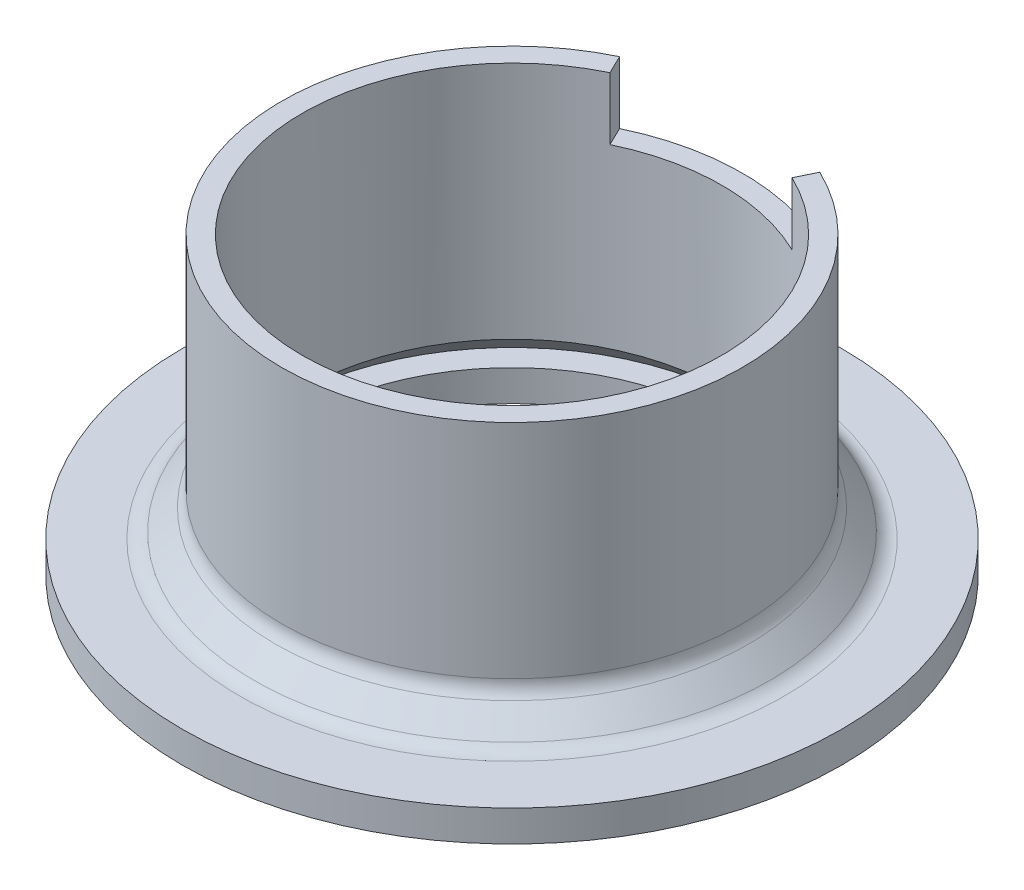
ISO-10303-21;
HEADER;
FILE_DESCRIPTION(('STEP AP214'),'2;1');
FILE_NAME('part.step','',(''),(''),'','','');
FILE_SCHEMA(('AUTOMOTIVE_DESIGN { 1 0 10303 214 1 1 1 1 }'));
ENDSEC;
DATA;
#1=APPLICATION_CONTEXT('core data for automotive mechanical design processes');
#2=APPLICATION_PROTOCOL_DEFINITION('international standard','automotive_design',2000,#1);
#3=PRODUCT_CONTEXT('',#1,'mechanical');
#4=PRODUCT('Part','Part','',(#3));
#5=PRODUCT_RELATED_PRODUCT_CATEGORY('part','',(#4));
#6=PRODUCT_DEFINITION_FORMATION('','',#4);
#7=PRODUCT_DEFINITION_CONTEXT('part definition',#1,'design');
#8=PRODUCT_DEFINITION('design','',#6,#7);
#9=PRODUCT_DEFINITION_SHAPE('','',#8);
#10=(LENGTH_UNIT() NAMED_UNIT(*) SI_UNIT(.MILLI.,.METRE.));
#11=(NAMED_UNIT(*) PLANE_ANGLE_UNIT() SI_UNIT($,.RADIAN.));
#12=(NAMED_UNIT(*) SI_UNIT($,.STERADIAN.) SOLID_ANGLE_UNIT());
#13=UNCERTAINTY_MEASURE_WITH_UNIT(LENGTH_MEASURE(1.E-05),#10,'distance_accuracy_value','');
#14=(GEOMETRIC_REPRESENTATION_CONTEXT(3) GLOBAL_UNCERTAINTY_ASSIGNED_CONTEXT((#13)) GLOBAL_UNIT_ASSIGNED_CONTEXT((#10,
#11,#12)) REPRESENTATION_CONTEXT('',''));
#15=CARTESIAN_POINT('',(0.,0.,0.));
#16=DIRECTION('',(0.,0.,1.));
#17=DIRECTION('',(1.,0.,0.));
#18=AXIS2_PLACEMENT_3D('',#15,#16,#17);
#19=CARTESIAN_POINT('',(0.,0.,0.));
#20=DIRECTION('',(0.,-1.,0.));
#21=DIRECTION('',(0.,0.,-1.));
#22=AXIS2_PLACEMENT_3D('',#19,#20,#21);
#23=CONICAL_SURFACE('',#22,22.5715728752538,0.785398163397448);
#24=CARTESIAN_POINT('',(0.,0.,0.));
#25=DIRECTION('',(0.,1.,0.));
#26=DIRECTION('',(0.,0.,1.));
#27=AXIS2_PLACEMENT_3D('',#24,#25,#26);
#28=CIRCLE('',#27,22.5715728752538);
#29=CARTESIAN_POINT('',(1.00000000000024,0.,22.5494102375848));
#30=VERTEX_POINT('',#29);
#31=CARTESIAN_POINT('',(22.5494102375848,0.,1.));
#32=VERTEX_POINT('',#31);
#33=EDGE_CURVE('E211',#30,#32,#28,.T.);
#34=ORIENTED_EDGE('',*,*,#33,.F.);
#35=CARTESIAN_POINT('',(1.00000000000027,-3.0926493253987,25.644732425285));
#36=CARTESIAN_POINT('',(1.00000000000026,-2.38144524293219,24.9329862035659));
#37=CARTESIAN_POINT('',(1.00000000000025,-1.67026202271059,24.2212191333853));
#38=CARTESIAN_POINT('',(1.00000000000024,-0.247954460315439,22.7976261871441));
#39=CARTESIAN_POINT('',(1.00000000000023,0.463169881858879,22.0858003110842));
#40=CARTESIAN_POINT('',(1.00000000000022,1.88534255816285,20.6620726205477));
#41=CARTESIAN_POINT('',(1.00000000000021,2.59639089229196,19.9501708060707));
#42=CARTESIAN_POINT('',(1.00000000000019,4.01837974852563,18.5262594934386));
#43=CARTESIAN_POINT('',(1.00000000000019,4.72932027062876,17.8142499952823));
#44=CARTESIAN_POINT('',(1.00000000000018,5.44019097783295,17.10217078956));
#45=B_SPLINE_CURVE_WITH_KNOTS('',3,(#35,#36,#37,#38,#39,#40,#41,#42,#43,#44),.UNSPECIFIED.,.F.,
.F.,(4,2,2,2,4),(0.,3.01853364877657,6.03706725821883,9.05560088899381,12.0741345597101),.UNSPECIFIED.);
#46=CARTESIAN_POINT('',(1.00000000000021,2.34683554692244,20.2));
#47=VERTEX_POINT('',#46);
#48=EDGE_CURVE('E462',#30,#47,#45,.T.);
#49=ORIENTED_EDGE('',*,*,#48,.T.);
#50=CARTESIAN_POINT('',(-6.5069413407723,1.34940791471657,20.2000000000001));
#51=CARTESIAN_POINT('',(-6.27177744659428,1.42151188061224,20.2000000000001));
#52=CARTESIAN_POINT('',(-6.035627758326,1.49037548259756,20.2000000000001));
#53=CARTESIAN_POINT('',(-5.56140065408711,1.62122178355149,20.2000000000001));
#54=CARTESIAN_POINT('',(-5.32332300692677,1.68320364378869,20.2000000000001));
#55=CARTESIAN_POINT('',(-4.60601502671594,1.85828278435188,20.2));
#56=CARTESIAN_POINT('',(-4.12403971023993,1.96041133415662,20.2));
#57=CARTESIAN_POINT('',(-3.16355454162542,2.1307071040694,20.2));
#58=CARTESIAN_POINT('',(-2.68515289396587,2.19948283286201,20.2));
#59=CARTESIAN_POINT('',(-1.72487503342651,2.30367834314739,20.2));
#60=CARTESIAN_POINT('',(-1.24300024462189,2.33911109036389,20.2));
#61=CARTESIAN_POINT('',(-0.277385611884381,2.37543620653485,20.2));
#62=CARTESIAN_POINT('',(0.206355732604704,2.37628912458079,20.2));
#63=CARTESIAN_POINT('',(1.17279146788919,2.34332329522053,20.2));
#64=CARTESIAN_POINT('',(1.65548546383504,2.30949319051694,20.2));
#65=CARTESIAN_POINT('',(2.62662851013934,2.20735054038173,20.2));
#66=CARTESIAN_POINT('',(3.1150090788247,2.13838571552495,20.2));
#67=CARTESIAN_POINT('',(3.84307622424172,2.0106377609058,20.2));
#68=CARTESIAN_POINT('',(4.08497087652045,1.96401572473394,20.2));
#69=CARTESIAN_POINT('',(4.56711753771044,1.86304800041714,20.2));
#70=CARTESIAN_POINT('',(4.8073697202366,1.80870314225827,20.2));
#71=CARTESIAN_POINT('',(5.04674065574689,1.75067973287477,20.1999999999999));
#72=B_SPLINE_CURVE_WITH_KNOTS('',3,(#50,#51,#52,#53,#54,#55,#56,#57,#58,#59,#60,#61,#62,#63,#64,
#65,#66,#67,#68,#69,#70,#71),.UNSPECIFIED.,.F.,.F.,(4,2,2,2,2,2,2,2,2,2,4),(0.,
0.737864513970868,1.47581885874038,2.95276251623984,4.40163875350358,5.8499513488727,
7.29991622660368,8.75035606131851,10.2287618292153,10.9676947858209,11.7065483879013),.UNSPECIFIED.);
#73=CARTESIAN_POINT('',(2.11583769133894E-13,2.37157287525381,20.2));
#74=VERTEX_POINT('',#73);
#75=EDGE_CURVE('E488',#74,#47,#72,.T.);
#76=ORIENTED_EDGE('',*,*,#75,.F.);
#77=CARTESIAN_POINT('',(0.,2.37157287525381,0.));
#78=DIRECTION('',(0.,1.,0.));
#79=DIRECTION('',(0.,0.,1.));
#80=AXIS2_PLACEMENT_3D('',#77,#78,#79);
#81=CIRCLE('',#80,20.2);
#82=CARTESIAN_POINT('',(20.2,2.37157287525381,0.));
#83=VERTEX_POINT('',#82);
#84=EDGE_CURVE('E216',#74,#83,#81,.T.);
#85=ORIENTED_EDGE('',*,*,#84,.T.);
#86=CARTESIAN_POINT('',(20.2,1.75067973287477,5.04674065574667));
#87=CARTESIAN_POINT('',(20.2,1.80870314225827,4.80736972023639));
#88=CARTESIAN_POINT('',(20.2,1.86304800041714,4.56711753771022));
#89=CARTESIAN_POINT('',(20.2,1.96401572473394,4.08497087652023));
#90=CARTESIAN_POINT('',(20.2,2.0106377609058,3.8430762242415));
#91=CARTESIAN_POINT('',(20.2,2.13838571552495,3.11500907882448));
#92=CARTESIAN_POINT('',(20.2,2.20735054038173,2.62662851013912));
#93=CARTESIAN_POINT('',(20.2,2.30949319051693,1.65548546383482));
#94=CARTESIAN_POINT('',(20.2,2.34332329522053,1.17279146788897));
#95=CARTESIAN_POINT('',(20.2,2.37628912458079,0.206355732604489));
#96=CARTESIAN_POINT('',(20.2,2.37543620653485,-0.277385611884596));
#97=CARTESIAN_POINT('',(20.2,2.33911109036389,-1.24300024462211));
#98=CARTESIAN_POINT('',(20.2,2.30367834314739,-1.72487503342673));
#99=CARTESIAN_POINT('',(20.2,2.19948283286201,-2.68515289396609));
#100=CARTESIAN_POINT('',(20.2,2.1307071040694,-3.16355454162564));
#101=CARTESIAN_POINT('',(20.2,1.96041133415662,-4.12403971024014));
#102=CARTESIAN_POINT('',(20.2,1.85828278435188,-4.60601502671615));
#103=CARTESIAN_POINT('',(20.2,1.68320364378869,-5.32332300692699));
#104=CARTESIAN_POINT('',(20.2,1.62122178355149,-5.56140065408732));
#105=CARTESIAN_POINT('',(20.2,1.49037548259757,-6.03562775832621));
#106=CARTESIAN_POINT('',(20.2,1.42151188061224,-6.27177744659449));
#107=CARTESIAN_POINT('',(20.2,1.34940791471657,-6.50694134077251));
#108=B_SPLINE_CURVE_WITH_KNOTS('',3,(#86,#87,#88,#89,#90,#91,#92,#93,#94,#95,#96,#97,#98,#99,
#100,#101,#102,#103,#104,#105,#106,#107),.UNSPECIFIED.,.F.,.F.,(4,2,2,2,2,2,2,2,2,2,4),(0.,
0.738853602080394,1.47778655868599,2.95619232658281,4.40663216129764,5.85659703902863,
7.30490963439775,8.75378587166148,10.2307295291609,10.9686838739305,11.7065483879013),.UNSPECIFIED.);
#109=CARTESIAN_POINT('',(20.2,2.34683554692244,1.));
#110=VERTEX_POINT('',#109);
#111=EDGE_CURVE('E242',#110,#83,#108,.T.);
#112=ORIENTED_EDGE('',*,*,#111,.F.);
#113=CARTESIAN_POINT('',(25.644732425285,-3.09264932539868,1.));
#114=CARTESIAN_POINT('',(24.9329862035659,-2.38144524293218,1.));
#115=CARTESIAN_POINT('',(24.2212191333853,-1.67026202271058,1.));
#116=CARTESIAN_POINT('',(22.7976261871441,-0.247954460315433,1.));
#117=CARTESIAN_POINT('',(22.0858003110842,0.463169881858883,1.));
#118=CARTESIAN_POINT('',(20.6620726205477,1.88534255816285,1.));
#119=CARTESIAN_POINT('',(19.9501708060707,2.59639089229196,1.));
#120=CARTESIAN_POINT('',(18.5262594934387,4.01837974852563,1.));
#121=CARTESIAN_POINT('',(17.8142499952823,4.72932027062875,1.));
#122=CARTESIAN_POINT('',(17.10217078956,5.44019097783294,1.));
#123=B_SPLINE_CURVE_WITH_KNOTS('',3,(#113,#114,#115,#116,#117,#118,#119,#120,#121,#122),
.UNSPECIFIED.,.F.,.F.,(4,2,2,2,4),(0.,3.01853364877657,6.03706725821882,9.05560088899379,
12.0741345597101),.UNSPECIFIED.);
#124=EDGE_CURVE('E396',#32,#110,#123,.T.);
#125=ORIENTED_EDGE('',*,*,#124,.F.);
#126=EDGE_LOOP('',(#34,#49,#76,#85,#112,#125));
#127=FACE_BOUND('',#126,.T.);
#128=ADVANCED_FACE('F36',(#127),#23,.F.);
#129=CARTESIAN_POINT('',(0.,0.,0.));
#130=DIRECTION('',(0.,-1.,0.));
#131=DIRECTION('',(0.,0.,-1.));
#132=AXIS2_PLACEMENT_3D('',#129,#130,#131);
#133=PLANE('',#132);
#134=DIRECTION('',(0.,0.,1.));
#135=VECTOR('',#134,1.);
#136=CARTESIAN_POINT('',(1.00000000000021,0.,20.2));
#137=LINE('',#136,#135);
#138=CARTESIAN_POINT('',(1.00000000000021,0.,20.2));
#139=VERTEX_POINT('',#138);
#140=EDGE_CURVE('E496',#139,#30,#137,.T.);
#141=ORIENTED_EDGE('',*,*,#140,.T.);
#142=ORIENTED_EDGE('',*,*,#33,.T.);
#143=DIRECTION('',(1.,0.,0.));
#144=VECTOR('',#143,1.);
#145=CARTESIAN_POINT('',(20.2,0.,1.));
#146=LINE('',#145,#144);
#147=CARTESIAN_POINT('',(20.2,0.,1.));
#148=VERTEX_POINT('',#147);
#149=EDGE_CURVE('E385',#148,#32,#146,.T.);
#150=ORIENTED_EDGE('',*,*,#149,.F.);
#151=DIRECTION('',(0.,0.,1.));
#152=VECTOR('',#151,1.);
#153=CARTESIAN_POINT('',(20.2,0.,-1.));
#154=LINE('',#153,#152);
#155=CARTESIAN_POINT('',(20.2,0.,0.));
#156=VERTEX_POINT('',#155);
#157=EDGE_CURVE('E393',#156,#148,#154,.T.);
#158=ORIENTED_EDGE('',*,*,#157,.F.);
#159=CARTESIAN_POINT('',(0.,0.,0.));
#160=DIRECTION('',(0.,-1.,0.));
#161=DIRECTION('',(0.,0.,-1.));
#162=AXIS2_PLACEMENT_3D('',#159,#160,#161);
#163=CIRCLE('',#162,20.2);
#164=CARTESIAN_POINT('',(2.11583769133894E-13,0.,20.2));
#165=VERTEX_POINT('',#164);
#166=EDGE_CURVE('E228',#156,#165,#163,.T.);
#167=ORIENTED_EDGE('',*,*,#166,.T.);
#168=DIRECTION('',(-1.,0.,0.));
#169=VECTOR('',#168,1.);
#170=CARTESIAN_POINT('',(1.00000000000021,0.,20.2));
#171=LINE('',#170,#169);
#172=EDGE_CURVE('E494',#139,#165,#171,.T.);
#173=ORIENTED_EDGE('',*,*,#172,.F.);
#174=EDGE_LOOP('',(#141,#142,#150,#158,#167,#173));
#175=FACE_BOUND('',#174,.T.);
#176=ADVANCED_FACE('F276',(#175),#133,.F.);
#177=CARTESIAN_POINT('',(-0.999999999999788,2.34683554692244,20.2));
#178=VERTEX_POINT('',#177);
#179=EDGE_CURVE('E493',#178,#74,#72,.T.);
#180=ORIENTED_EDGE('',*,*,#179,.F.);
#181=CARTESIAN_POINT('',(-0.999999999999731,-3.09264932539868,25.644732425285));
#182=CARTESIAN_POINT('',(-0.999999999999739,-2.38144524293217,24.9329862035659));
#183=CARTESIAN_POINT('',(-0.999999999999746,-1.67026202271058,24.2212191333854));
#184=CARTESIAN_POINT('',(-0.999999999999761,-0.24795446031543,22.7976261871441));
#185=CARTESIAN_POINT('',(-0.999999999999769,0.463169881858885,22.0858003110842));
#186=CARTESIAN_POINT('',(-0.999999999999783,1.88534255816285,20.6620726205477));
#187=CARTESIAN_POINT('',(-0.999999999999791,2.59639089229196,19.9501708060707));
#188=CARTESIAN_POINT('',(-0.999999999999806,4.01837974852562,18.5262594934387));
#189=CARTESIAN_POINT('',(-0.999999999999813,4.72932027062875,17.8142499952823));
#190=CARTESIAN_POINT('',(-0.999999999999821,5.44019097783294,17.10217078956));
#191=B_SPLINE_CURVE_WITH_KNOTS('',3,(#181,#182,#183,#184,#185,#186,#187,#188,#189,#190),
.UNSPECIFIED.,.F.,.F.,(4,2,2,2,4),(0.,3.01853364877656,6.03706725821881,9.05560088899377,
12.0741345597101),.UNSPECIFIED.);
#192=CARTESIAN_POINT('',(-0.999999999999764,0.,22.5494102375848));
#193=VERTEX_POINT('',#192);
#194=EDGE_CURVE('E469',#193,#178,#191,.T.);
#195=ORIENTED_EDGE('',*,*,#194,.F.);
#196=CARTESIAN_POINT('',(-22.5494102375848,0.,1.));
#197=VERTEX_POINT('',#196);
#198=EDGE_CURVE('E444',#197,#193,#28,.T.);
#199=ORIENTED_EDGE('',*,*,#198,.F.);
#200=CARTESIAN_POINT('',(-26.5345643924501,-3.98182817804029,1.));
#201=CARTESIAN_POINT('',(-25.8228361059004,-3.27060615055294,1.));
#202=CARTESIAN_POINT('',(-25.111088892155,-2.55940306206986,1.));
#203=CARTESIAN_POINT('',(-23.6875418845975,-1.13704952407763,1.));
#204=CARTESIAN_POINT('',(-22.975742090786,-0.425899074567931,1.));
#205=CARTESIAN_POINT('',(-21.5520751792395,0.996334442681487,1.));
#206=CARTESIAN_POINT('',(-20.8402080615041,1.70741751042085,1.));
#207=CARTESIAN_POINT('',(-19.4163798851905,3.12948960250176,1.));
#208=CARTESIAN_POINT('',(-18.7044188266114,3.84047862684233,1.));
#209=CARTESIAN_POINT('',(-17.9923974945828,4.55140729324345,1.));
#210=B_SPLINE_CURVE_WITH_KNOTS('',3,(#200,#201,#202,#203,#204,#205,#206,#207,#208,#209),
.UNSPECIFIED.,.F.,.F.,(4,2,2,2,4),(0.,3.01853364130784,6.03706725202868,9.05560087868852,
12.0741345363519),.UNSPECIFIED.);
#211=CARTESIAN_POINT('',(-20.2,2.34683554692244,1.));
#212=VERTEX_POINT('',#211);
#213=EDGE_CURVE('E334',#197,#212,#210,.T.);
#214=ORIENTED_EDGE('',*,*,#213,.T.);
#215=CARTESIAN_POINT('',(-20.2,1.34940791471657,-6.50694134077251));
#216=CARTESIAN_POINT('',(-20.2,1.42151188061224,-6.27177744659449));
#217=CARTESIAN_POINT('',(-20.2,1.49037548259757,-6.03562775832621));
#218=CARTESIAN_POINT('',(-20.2,1.62122178355149,-5.56140065408732));
#219=CARTESIAN_POINT('',(-20.2,1.68320364378869,-5.32332300692699));
#220=CARTESIAN_POINT('',(-20.2,1.85828278435188,-4.60601502671615));
#221=CARTESIAN_POINT('',(-20.2,1.96041133415662,-4.12403971024014));
#222=CARTESIAN_POINT('',(-20.2,2.1307071040694,-3.16355454162564));
#223=CARTESIAN_POINT('',(-20.2,2.19948283286201,-2.68515289396608));
#224=CARTESIAN_POINT('',(-20.2,2.30367834314739,-1.72487503342673));
#225=CARTESIAN_POINT('',(-20.2,2.33911109036389,-1.2430002446221));
#226=CARTESIAN_POINT('',(-20.2,2.37543620653485,-0.277385611884593));
#227=CARTESIAN_POINT('',(-20.2,2.37628912458079,0.206355732604492));
#228=CARTESIAN_POINT('',(-20.2,2.34332329522053,1.17279146788898));
#229=CARTESIAN_POINT('',(-20.2,2.30949319051694,1.65548546383483));
#230=CARTESIAN_POINT('',(-20.2,2.20735054038173,2.62662851013912));
#231=CARTESIAN_POINT('',(-20.2,2.13838571552495,3.11500907882448));
#232=CARTESIAN_POINT('',(-20.2,2.0106377609058,3.8430762242415));
#233=CARTESIAN_POINT('',(-20.2,1.96401572473394,4.08497087652023));
#234=CARTESIAN_POINT('',(-20.2,1.86304800041714,4.56711753771022));
#235=CARTESIAN_POINT('',(-20.2,1.80870314225827,4.80736972023639));
#236=CARTESIAN_POINT('',(-20.2,1.75067973287477,5.04674065574667));
#237=B_SPLINE_CURVE_WITH_KNOTS('',3,(#215,#216,#217,#218,#219,#220,#221,#222,#223,#224,#225,
#226,#227,#228,#229,#230,#231,#232,#233,#234,#235,#236),.UNSPECIFIED.,.F.,.F.,(4,2,2,2,2,2,2,2,
2,2,4),(0.,0.737864513970868,1.47581885874038,2.95276251623984,4.40163875350357,5.8499513488727,
7.29991622660368,8.75035606131851,10.2287618292153,10.9676947858209,11.7065483879013),.UNSPECIFIED.);
#238=CARTESIAN_POINT('',(-20.2,2.37157287525381,0.));
#239=VERTEX_POINT('',#238);
#240=EDGE_CURVE('E332',#239,#212,#237,.T.);
#241=ORIENTED_EDGE('',*,*,#240,.F.);
#242=EDGE_CURVE('E535',#239,#74,#81,.T.);
#243=ORIENTED_EDGE('',*,*,#242,.T.);
#244=EDGE_LOOP('',(#180,#195,#199,#214,#241,#243));
#245=FACE_BOUND('',#244,.T.);
#246=ADVANCED_FACE('F296',(#245),#23,.F.);
#247=DIRECTION('',(0.,0.,1.));
#248=VECTOR('',#247,1.);
#249=CARTESIAN_POINT('',(-0.999999999999788,0.,20.2));
#250=LINE('',#249,#248);
#251=CARTESIAN_POINT('',(-0.999999999999788,0.,20.2));
#252=VERTEX_POINT('',#251);
#253=EDGE_CURVE('E501',#252,#193,#250,.T.);
#254=ORIENTED_EDGE('',*,*,#253,.F.);
#255=EDGE_CURVE('E57',#165,#252,#171,.T.);
#256=ORIENTED_EDGE('',*,*,#255,.F.);
#257=CARTESIAN_POINT('',(-20.2,0.,0.));
#258=VERTEX_POINT('',#257);
#259=EDGE_CURVE('E231',#165,#258,#163,.T.);
#260=ORIENTED_EDGE('',*,*,#259,.T.);
#261=DIRECTION('',(0.,0.,-1.));
#262=VECTOR('',#261,1.);
#263=CARTESIAN_POINT('',(-20.2,0.,1.));
#264=LINE('',#263,#262);
#265=CARTESIAN_POINT('',(-20.2,0.,1.));
#266=VERTEX_POINT('',#265);
#267=EDGE_CURVE('E336',#266,#258,#264,.T.);
#268=ORIENTED_EDGE('',*,*,#267,.F.);
#269=DIRECTION('',(-1.,0.,0.));
#270=VECTOR('',#269,1.);
#271=CARTESIAN_POINT('',(-20.2,0.,1.));
#272=LINE('',#271,#270);
#273=EDGE_CURVE('E449',#266,#197,#272,.T.);
#274=ORIENTED_EDGE('',*,*,#273,.T.);
#275=ORIENTED_EDGE('',*,*,#198,.T.);
#276=EDGE_LOOP('',(#254,#256,#260,#268,#274,#275));
#277=FACE_BOUND('',#276,.T.);
#278=ADVANCED_FACE('F301',(#277),#133,.F.);
#279=CARTESIAN_POINT('',(-20.2,2.34683554692244,-1.));
#280=VERTEX_POINT('',#279);
#281=EDGE_CURVE('E323',#280,#239,#237,.T.);
#282=ORIENTED_EDGE('',*,*,#281,.F.);
#283=CARTESIAN_POINT('',(-26.5345643924501,-3.98182817804029,-1.));
#284=CARTESIAN_POINT('',(-25.8228361059004,-3.27060615055294,-1.));
#285=CARTESIAN_POINT('',(-25.111088892155,-2.55940306206986,-1.));
#286=CARTESIAN_POINT('',(-23.6875418845975,-1.13704952407763,-1.));
#287=CARTESIAN_POINT('',(-22.975742090786,-0.425899074567931,-1.));
#288=CARTESIAN_POINT('',(-21.5520751792395,0.996334442681487,-1.));
#289=CARTESIAN_POINT('',(-20.8402080615041,1.70741751042085,-1.));
#290=CARTESIAN_POINT('',(-19.4163798851905,3.12948960250176,-1.));
#291=CARTESIAN_POINT('',(-18.7044188266114,3.84047862684233,-1.));
#292=CARTESIAN_POINT('',(-17.9923974945828,4.55140729324345,-1.));
#293=B_SPLINE_CURVE_WITH_KNOTS('',3,(#283,#284,#285,#286,#287,#288,#289,#290,#291,#292),
.UNSPECIFIED.,.F.,.F.,(4,2,2,2,4),(0.,3.01853364130784,6.03706725202868,9.05560087868852,
12.0741345363519),.UNSPECIFIED.);
#294=CARTESIAN_POINT('',(-22.5494102375848,0.,-1.));
#295=VERTEX_POINT('',#294);
#296=EDGE_CURVE('E325',#295,#280,#293,.T.);
#297=ORIENTED_EDGE('',*,*,#296,.F.);
#298=CARTESIAN_POINT('',(-1.00000000000008,0.,-22.5494102375848));
#299=VERTEX_POINT('',#298);
#300=EDGE_CURVE('E210',#299,#295,#28,.T.);
#301=ORIENTED_EDGE('',*,*,#300,.F.);
#302=CARTESIAN_POINT('',(-1.00000000000009,-3.98182817804029,-26.5345643924501));
#303=CARTESIAN_POINT('',(-1.00000000000009,-3.27060615055294,-25.8228361059004));
#304=CARTESIAN_POINT('',(-1.00000000000009,-2.55940306206987,-25.1110888921549));
#305=CARTESIAN_POINT('',(-1.00000000000008,-1.13704952407763,-23.6875418845975));
#306=CARTESIAN_POINT('',(-1.00000000000008,-0.425899074567931,-22.975742090786));
#307=CARTESIAN_POINT('',(-1.00000000000008,0.996334442681486,-21.5520751792395));
#308=CARTESIAN_POINT('',(-1.00000000000007,1.70741751042085,-20.8402080615041));
#309=CARTESIAN_POINT('',(-1.00000000000007,3.12948960250175,-19.4163798851905));
#310=CARTESIAN_POINT('',(-1.00000000000007,3.84047862684233,-18.7044188266114));
#311=CARTESIAN_POINT('',(-1.00000000000006,4.55140729324345,-17.9923974945828));
#312=B_SPLINE_CURVE_WITH_KNOTS('',3,(#302,#303,#304,#305,#306,#307,#308,#309,#310,#311),
.UNSPECIFIED.,.F.,.F.,(4,2,2,2,4),(0.,3.01853364130784,6.03706725202869,9.05560087868852,
12.0741345363519),.UNSPECIFIED.);
#313=CARTESIAN_POINT('',(-1.00000000000007,2.34683554692244,-20.2));
#314=VERTEX_POINT('',#313);
#315=EDGE_CURVE('E370',#299,#314,#312,.T.);
#316=ORIENTED_EDGE('',*,*,#315,.T.);
#317=CARTESIAN_POINT('',(5.0467406557466,1.75067973287477,-20.2));
#318=CARTESIAN_POINT('',(4.80736972023632,1.80870314225826,-20.2));
#319=CARTESIAN_POINT('',(4.56711753771015,1.86304800041714,-20.2));
#320=CARTESIAN_POINT('',(4.08497087652016,1.96401572473394,-20.2));
#321=CARTESIAN_POINT('',(3.84307622424143,2.0106377609058,-20.2));
#322=CARTESIAN_POINT('',(3.11500907882441,2.13838571552495,-20.2));
#323=CARTESIAN_POINT('',(2.62662851013905,2.20735054038173,-20.2));
#324=CARTESIAN_POINT('',(1.65548546383475,2.30949319051693,-20.2));
#325=CARTESIAN_POINT('',(1.1727914678889,2.34332329522053,-20.2));
#326=CARTESIAN_POINT('',(0.206355732604418,2.37628912458079,-20.2));
#327=CARTESIAN_POINT('',(-0.277385611884667,2.37543620653485,-20.2));
#328=CARTESIAN_POINT('',(-1.24300024462218,2.33911109036389,-20.2));
#329=CARTESIAN_POINT('',(-1.7248750334268,2.30367834314739,-20.2));
#330=CARTESIAN_POINT('',(-2.68515289396616,2.19948283286201,-20.2));
#331=CARTESIAN_POINT('',(-3.16355454162571,2.1307071040694,-20.2));
#332=CARTESIAN_POINT('',(-4.12403971024021,1.96041133415662,-20.2));
#333=CARTESIAN_POINT('',(-4.60601502671622,1.85828278435188,-20.2));
#334=CARTESIAN_POINT('',(-5.32332300692705,1.68320364378869,-20.2));
#335=CARTESIAN_POINT('',(-5.56140065408739,1.62122178355149,-20.2));
#336=CARTESIAN_POINT('',(-6.03562775832628,1.49037548259756,-20.2));
#337=CARTESIAN_POINT('',(-6.27177744659457,1.42151188061224,-20.2));
#338=CARTESIAN_POINT('',(-6.50694134077258,1.34940791471657,-20.2));
#339=B_SPLINE_CURVE_WITH_KNOTS('',3,(#317,#318,#319,#320,#321,#322,#323,#324,#325,#326,#327,
#328,#329,#330,#331,#332,#333,#334,#335,#336,#337,#338),.UNSPECIFIED.,.F.,.F.,(4,2,2,2,2,2,2,2,
2,2,4),(0.,0.738853602080395,1.47778655868599,2.95619232658281,4.40663216129764,
5.85659703902863,7.30490963439775,8.75378587166148,10.2307295291609,10.9686838739305,
11.7065483879013),.UNSPECIFIED.);
#340=CARTESIAN_POINT('',(0.,2.37157287525381,-20.2));
#341=VERTEX_POINT('',#340);
#342=EDGE_CURVE('E372',#341,#314,#339,.T.);
#343=ORIENTED_EDGE('',*,*,#342,.F.);
#344=EDGE_CURVE('E215',#341,#239,#81,.T.);
#345=ORIENTED_EDGE('',*,*,#344,.T.);
#346=EDGE_LOOP('',(#282,#297,#301,#316,#343,#345));
#347=FACE_BOUND('',#346,.T.);
#348=ADVANCED_FACE('F305',(#347),#23,.F.);
#349=DIRECTION('',(-1.,0.,0.));
#350=VECTOR('',#349,1.);
#351=CARTESIAN_POINT('',(-20.2,0.,-1.));
#352=LINE('',#351,#350);
#353=CARTESIAN_POINT('',(-20.2,0.,-1.));
#354=VERTEX_POINT('',#353);
#355=EDGE_CURVE('E455',#354,#295,#352,.T.);
#356=ORIENTED_EDGE('',*,*,#355,.F.);
#357=EDGE_CURVE('E454',#258,#354,#264,.T.);
#358=ORIENTED_EDGE('',*,*,#357,.F.);
#359=CARTESIAN_POINT('',(0.,0.,-20.2));
#360=VERTEX_POINT('',#359);
#361=EDGE_CURVE('E546',#258,#360,#163,.T.);
#362=ORIENTED_EDGE('',*,*,#361,.T.);
#363=DIRECTION('',(1.,0.,0.));
#364=VECTOR('',#363,1.);
#365=CARTESIAN_POINT('',(-1.00000000000007,0.,-20.2));
#366=LINE('',#365,#364);
#367=CARTESIAN_POINT('',(-1.00000000000007,0.,-20.2));
#368=VERTEX_POINT('',#367);
#369=EDGE_CURVE('E425',#368,#360,#366,.T.);
#370=ORIENTED_EDGE('',*,*,#369,.F.);
#371=DIRECTION('',(0.,0.,-1.));
#372=VECTOR('',#371,1.);
#373=CARTESIAN_POINT('',(-1.00000000000007,0.,-20.2));
#374=LINE('',#373,#372);
#375=EDGE_CURVE('E428',#368,#299,#374,.T.);
#376=ORIENTED_EDGE('',*,*,#375,.T.);
#377=ORIENTED_EDGE('',*,*,#300,.T.);
#378=EDGE_LOOP('',(#356,#358,#362,#370,#376,#377));
#379=FACE_BOUND('',#378,.T.);
#380=ADVANCED_FACE('F307',(#379),#133,.F.);
#381=CARTESIAN_POINT('',(0.99999999999993,2.34683554692244,-20.2));
#382=VERTEX_POINT('',#381);
#383=EDGE_CURVE('E371',#382,#341,#339,.T.);
#384=ORIENTED_EDGE('',*,*,#383,.F.);
#385=CARTESIAN_POINT('',(0.999999999999907,-3.98182817804028,-26.5345643924501));
#386=CARTESIAN_POINT('',(0.99999999999991,-3.27060615055293,-25.8228361059004));
#387=CARTESIAN_POINT('',(0.999999999999912,-2.55940306206986,-25.1110888921549));
#388=CARTESIAN_POINT('',(0.999999999999917,-1.13704952407762,-23.6875418845975));
#389=CARTESIAN_POINT('',(0.99999999999992,-0.425899074567926,-22.975742090786));
#390=CARTESIAN_POINT('',(0.999999999999925,0.996334442681492,-21.5520751792395));
#391=CARTESIAN_POINT('',(0.999999999999927,1.70741751042086,-20.8402080615041));
#392=CARTESIAN_POINT('',(0.999999999999932,3.12948960250176,-19.4163798851905));
#393=CARTESIAN_POINT('',(0.999999999999935,3.84047862684233,-18.7044188266114));
#394=CARTESIAN_POINT('',(0.999999999999937,4.55140729324345,-17.9923974945828));
#395=B_SPLINE_CURVE_WITH_KNOTS('',3,(#385,#386,#387,#388,#389,#390,#391,#392,#393,#394),
.UNSPECIFIED.,.F.,.F.,(4,2,2,2,4),(0.,3.01853364130784,6.03706725202868,9.05560087868852,
12.0741345363519),.UNSPECIFIED.);
#396=CARTESIAN_POINT('',(0.999999999999921,0.,-22.5494102375848));
#397=VERTEX_POINT('',#396);
#398=EDGE_CURVE('E364',#397,#382,#395,.T.);
#399=ORIENTED_EDGE('',*,*,#398,.F.);
#400=CARTESIAN_POINT('',(22.5494102375848,0.,-1.));
#401=VERTEX_POINT('',#400);
#402=EDGE_CURVE('E207',#401,#397,#28,.T.);
#403=ORIENTED_EDGE('',*,*,#402,.F.);
#404=CARTESIAN_POINT('',(25.644732425285,-3.09264932539868,-1.));
#405=CARTESIAN_POINT('',(24.9329862035659,-2.38144524293218,-1.));
#406=CARTESIAN_POINT('',(24.2212191333853,-1.67026202271058,-1.));
#407=CARTESIAN_POINT('',(22.7976261871441,-0.247954460315433,-1.));
#408=CARTESIAN_POINT('',(22.0858003110842,0.463169881858883,-1.));
#409=CARTESIAN_POINT('',(20.6620726205477,1.88534255816285,-1.));
#410=CARTESIAN_POINT('',(19.9501708060707,2.59639089229196,-1.));
#411=CARTESIAN_POINT('',(18.5262594934387,4.01837974852563,-1.));
#412=CARTESIAN_POINT('',(17.8142499952823,4.72932027062875,-1.));
#413=CARTESIAN_POINT('',(17.10217078956,5.44019097783294,-1.));
#414=B_SPLINE_CURVE_WITH_KNOTS('',3,(#404,#405,#406,#407,#408,#409,#410,#411,#412,#413),
.UNSPECIFIED.,.F.,.F.,(4,2,2,2,4),(0.,3.01853364877657,6.03706725821882,9.05560088899379,
12.0741345597101),.UNSPECIFIED.);
#415=CARTESIAN_POINT('',(20.2,2.34683554692244,-1.));
#416=VERTEX_POINT('',#415);
#417=EDGE_CURVE('E243',#401,#416,#414,.T.);
#418=ORIENTED_EDGE('',*,*,#417,.T.);
#419=EDGE_CURVE('E235',#83,#416,#108,.T.);
#420=ORIENTED_EDGE('',*,*,#419,.F.);
#421=EDGE_CURVE('E212',#83,#341,#81,.T.);
#422=ORIENTED_EDGE('',*,*,#421,.T.);
#423=EDGE_LOOP('',(#384,#399,#403,#418,#420,#422));
#424=FACE_BOUND('',#423,.T.);
#425=ADVANCED_FACE('F249',(#424),#23,.F.);
#426=DIRECTION('',(0.,0.,-1.));
#427=VECTOR('',#426,1.);
#428=CARTESIAN_POINT('',(0.99999999999993,0.,-20.2));
#429=LINE('',#428,#427);
#430=CARTESIAN_POINT('',(0.99999999999993,0.,-20.2));
#431=VERTEX_POINT('',#430);
#432=EDGE_CURVE('E419',#431,#397,#429,.T.);
#433=ORIENTED_EDGE('',*,*,#432,.F.);
#434=EDGE_CURVE('E417',#360,#431,#366,.T.);
#435=ORIENTED_EDGE('',*,*,#434,.F.);
#436=EDGE_CURVE('E232',#360,#156,#163,.T.);
#437=ORIENTED_EDGE('',*,*,#436,.T.);
#438=CARTESIAN_POINT('',(20.2,0.,-1.));
#439=VERTEX_POINT('',#438);
#440=EDGE_CURVE('E394',#439,#156,#154,.T.);
#441=ORIENTED_EDGE('',*,*,#440,.F.);
#442=DIRECTION('',(1.,0.,0.));
#443=VECTOR('',#442,1.);
#444=CARTESIAN_POINT('',(20.2,0.,-1.));
#445=LINE('',#444,#443);
#446=EDGE_CURVE('E390',#439,#401,#445,.T.);
#447=ORIENTED_EDGE('',*,*,#446,.T.);
#448=ORIENTED_EDGE('',*,*,#402,.T.);
#449=EDGE_LOOP('',(#433,#435,#437,#441,#447,#448));
#450=FACE_BOUND('',#449,.T.);
#451=ADVANCED_FACE('F271',(#450),#133,.F.);
#452=CARTESIAN_POINT('',(0.,25.4,0.));
#453=DIRECTION('',(0.,1.,0.));
#454=DIRECTION('',(0.,0.,1.));
#455=AXIS2_PLACEMENT_3D('',#452,#453,#454);
#456=CYLINDRICAL_SURFACE('',#455,20.2);
#457=CARTESIAN_POINT('',(0.,19.4,0.));
#458=DIRECTION('',(0.,1.,0.));
#459=DIRECTION('',(0.,0.,1.));
#460=AXIS2_PLACEMENT_3D('',#457,#458,#459);
#461=CIRCLE('',#460,20.2);
#462=CARTESIAN_POINT('',(-8.76730188479305,19.4,-18.1981981981982));
#463=VERTEX_POINT('',#462);
#464=CARTESIAN_POINT('',(8.76730188479307,19.4,-18.1981981981982));
#465=VERTEX_POINT('',#464);
#466=EDGE_CURVE('E505',#463,#465,#461,.F.);
#467=ORIENTED_EDGE('',*,*,#466,.F.);
#468=DIRECTION('',(0.,1.,0.));
#469=VECTOR('',#468,1.);
#470=CARTESIAN_POINT('',(-8.76730188479306,25.4,-18.1981981981982));
#471=LINE('',#470,#469);
#472=CARTESIAN_POINT('',(-8.76730188479306,25.4,-18.1981981981982));
#473=VERTEX_POINT('',#472);
#474=EDGE_CURVE('E179',#463,#473,#471,.T.);
#475=ORIENTED_EDGE('',*,*,#474,.T.);
#476=CARTESIAN_POINT('',(0.,25.4,0.));
#477=DIRECTION('',(0.,1.,0.));
#478=DIRECTION('',(0.,0.,1.));
#479=AXIS2_PLACEMENT_3D('',#476,#477,#478);
#480=CIRCLE('',#479,20.2);
#481=CARTESIAN_POINT('',(8.76730188479307,25.4,-18.1981981981982));
#482=VERTEX_POINT('',#481);
#483=EDGE_CURVE('E217',#473,#482,#480,.T.);
#484=ORIENTED_EDGE('',*,*,#483,.T.);
#485=DIRECTION('',(0.,1.,0.));
#486=VECTOR('',#485,1.);
#487=CARTESIAN_POINT('',(8.76730188479307,25.4,-18.1981981981982));
#488=LINE('',#487,#486);
#489=EDGE_CURVE('E507',#482,#465,#488,.F.);
#490=ORIENTED_EDGE('',*,*,#489,.T.);
#491=EDGE_LOOP('',(#467,#475,#484,#490));
#492=FACE_BOUND('',#491,.T.);
#493=ORIENTED_EDGE('',*,*,#84,.F.);
#494=ORIENTED_EDGE('',*,*,#242,.F.);
#495=ORIENTED_EDGE('',*,*,#344,.F.);
#496=ORIENTED_EDGE('',*,*,#421,.F.);
#497=EDGE_LOOP('',(#493,#494,#495,#496));
#498=FACE_BOUND('',#497,.T.);
#499=ADVANCED_FACE('F274',(#492,#498),#456,.F.);
#500=CARTESIAN_POINT('',(-12.7,25.4,0.));
#501=DIRECTION('',(0.,-1.,0.));
#502=DIRECTION('',(0.,0.,-1.));
#503=AXIS2_PLACEMENT_3D('',#500,#501,#502);
#504=PLANE('',#503);
#505=ORIENTED_EDGE('',*,*,#483,.F.);
#506=DIRECTION('',(0.434024845781835,0.,0.900900900900901));
#507=VECTOR('',#506,1.);
#508=CARTESIAN_POINT('',(-7.75318869812615,25.4,-16.0932139044121));
#509=LINE('',#508,#507);
#510=CARTESIAN_POINT('',(-9.63535157635672,25.4,-20.));
#511=VERTEX_POINT('',#510);
#512=EDGE_CURVE('E512',#511,#473,#509,.T.);
#513=ORIENTED_EDGE('',*,*,#512,.F.);
#514=CARTESIAN_POINT('',(0.,25.4,0.));
#515=DIRECTION('',(0.,1.,0.));
#516=DIRECTION('',(0.,0.,1.));
#517=AXIS2_PLACEMENT_3D('',#514,#515,#516);
#518=CIRCLE('',#517,22.2);
#519=CARTESIAN_POINT('',(9.63535157635675,25.4,-20.));
#520=VERTEX_POINT('',#519);
#521=EDGE_CURVE('E194',#511,#520,#518,.T.);
#522=ORIENTED_EDGE('',*,*,#521,.T.);
#523=DIRECTION('',(0.434024845781835,0.,-0.900900900900901));
#524=VECTOR('',#523,1.);
#525=CARTESIAN_POINT('',(9.63535157635675,25.4,-20.));
#526=LINE('',#525,#524);
#527=EDGE_CURVE('E182',#482,#520,#526,.T.);
#528=ORIENTED_EDGE('',*,*,#527,.F.);
#529=EDGE_LOOP('',(#505,#513,#522,#528));
#530=FACE_BOUND('',#529,.T.);
#531=ADVANCED_FACE('F286',(#530),#504,.F.);
#532=CARTESIAN_POINT('',(0.,25.4,0.));
#533=DIRECTION('',(0.,1.,0.));
#534=DIRECTION('',(0.,0.,1.));
#535=AXIS2_PLACEMENT_3D('',#532,#533,#534);
#536=CYLINDRICAL_SURFACE('',#535,22.2);
#537=DIRECTION('',(0.,1.,0.));
#538=VECTOR('',#537,1.);
#539=CARTESIAN_POINT('',(9.63535157635675,25.4,-20.));
#540=LINE('',#539,#538);
#541=CARTESIAN_POINT('',(9.63535157635672,19.4,-20.));
#542=VERTEX_POINT('',#541);
#543=EDGE_CURVE('E11',#520,#542,#540,.F.);
#544=ORIENTED_EDGE('',*,*,#543,.F.);
#545=ORIENTED_EDGE('',*,*,#521,.F.);
#546=DIRECTION('',(0.,1.,0.));
#547=VECTOR('',#546,1.);
#548=CARTESIAN_POINT('',(-9.63535157635672,25.4,-20.));
#549=LINE('',#548,#547);
#550=CARTESIAN_POINT('',(-9.63535157635672,19.4,-20.));
#551=VERTEX_POINT('',#550);
#552=EDGE_CURVE('E44',#551,#511,#549,.T.);
#553=ORIENTED_EDGE('',*,*,#552,.F.);
#554=CARTESIAN_POINT('',(0.,19.4,0.));
#555=DIRECTION('',(0.,1.,0.));
#556=DIRECTION('',(0.,0.,1.));
#557=AXIS2_PLACEMENT_3D('',#554,#555,#556);
#558=CIRCLE('',#557,22.2);
#559=EDGE_CURVE('E185',#551,#542,#558,.F.);
#560=ORIENTED_EDGE('',*,*,#559,.T.);
#561=EDGE_LOOP('',(#544,#545,#553,#560));
#562=FACE_BOUND('',#561,.T.);
#563=CARTESIAN_POINT('',(0.,4.02842712474616,0.));
#564=DIRECTION('',(0.,1.,0.));
#565=DIRECTION('',(0.,0.,1.));
#566=AXIS2_PLACEMENT_3D('',#563,#564,#565);
#567=CIRCLE('',#566,22.2);
#568=CARTESIAN_POINT('',(0.,4.02842712474616,22.2));
#569=VERTEX_POINT('',#568);
#570=EDGE_CURVE('E198',#569,#569,#567,.T.);
#571=ORIENTED_EDGE('',*,*,#570,.T.);
#572=EDGE_LOOP('',(#571));
#573=FACE_BOUND('',#572,.T.);
#574=ADVANCED_FACE('F191',(#562,#573),#536,.T.);
#575=CARTESIAN_POINT('',(0.,0.,0.));
#576=DIRECTION('',(0.,-1.,0.));
#577=DIRECTION('',(0.,0.,-1.));
#578=AXIS2_PLACEMENT_3D('',#575,#576,#577);
#579=CONICAL_SURFACE('',#578,25.4,0.785398163397453);
#580=CARTESIAN_POINT('',(0.,2.61421356237305,0.));
#581=DIRECTION('',(0.,1.,0.));
#582=DIRECTION('',(0.,0.,1.));
#583=AXIS2_PLACEMENT_3D('',#580,#581,#582);
#584=CIRCLE('',#583,22.7857864376269);
#585=CARTESIAN_POINT('',(0.,2.61421356237305,22.7857864376269));
#586=VERTEX_POINT('',#585);
#587=EDGE_CURVE('E188',#586,#586,#584,.F.);
#588=ORIENTED_EDGE('',*,*,#587,.T.);
#589=EDGE_LOOP('',(#588));
#590=FACE_BOUND('',#589,.T.);
#591=CARTESIAN_POINT('',(0.,0.585786437626908,0.));
#592=DIRECTION('',(0.,-1.,0.));
#593=DIRECTION('',(0.,0.,-1.));
#594=AXIS2_PLACEMENT_3D('',#591,#592,#593);
#595=CIRCLE('',#594,24.8142135623731);
#596=CARTESIAN_POINT('',(0.,0.585786437626908,-24.8142135623731));
#597=VERTEX_POINT('',#596);
#598=EDGE_CURVE('E201',#597,#597,#595,.F.);
#599=ORIENTED_EDGE('',*,*,#598,.T.);
#600=EDGE_LOOP('',(#599));
#601=FACE_BOUND('',#600,.T.);
#602=ADVANCED_FACE('F280',(#590,#601),#579,.T.);
#603=CARTESIAN_POINT('',(0.,0.,0.));
#604=DIRECTION('',(0.,-1.,0.));
#605=DIRECTION('',(0.,0.,-1.));
#606=AXIS2_PLACEMENT_3D('',#603,#604,#605);
#607=CIRCLE('',#606,26.2284271247462);
#608=CARTESIAN_POINT('',(0.,0.,-26.2284271247462));
#609=VERTEX_POINT('',#608);
#610=EDGE_CURVE('E204',#609,#609,#607,.T.);
#611=ORIENTED_EDGE('',*,*,#610,.T.);
#612=EDGE_LOOP('',(#611));
#613=FACE_BOUND('',#612,.T.);
#614=CARTESIAN_POINT('',(0.,0.,0.));
#615=DIRECTION('',(0.,-1.,0.));
#616=DIRECTION('',(0.,0.,-1.));
#617=AXIS2_PLACEMENT_3D('',#614,#615,#616);
#618=CIRCLE('',#617,31.75);
#619=CARTESIAN_POINT('',(0.,0.,-31.75));
#620=VERTEX_POINT('',#619);
#621=EDGE_CURVE('E222',#620,#620,#618,.T.);
#622=ORIENTED_EDGE('',*,*,#621,.F.);
#623=EDGE_LOOP('',(#622));
#624=FACE_BOUND('',#623,.T.);
#625=ADVANCED_FACE('F269',(#613,#624),#133,.F.);
#626=CARTESIAN_POINT('',(0.,-3.,0.));
#627=DIRECTION('',(0.,-1.,0.));
#628=DIRECTION('',(0.,0.,-1.));
#629=AXIS2_PLACEMENT_3D('',#626,#627,#628);
#630=PLANE('',#629);
#631=CARTESIAN_POINT('',(0.,-3.,0.));
#632=DIRECTION('',(0.,-1.,0.));
#633=DIRECTION('',(0.,0.,-1.));
#634=AXIS2_PLACEMENT_3D('',#631,#632,#633);
#635=CIRCLE('',#634,31.75);
#636=CARTESIAN_POINT('',(0.,-3.,-31.75));
#637=VERTEX_POINT('',#636);
#638=EDGE_CURVE('E221',#637,#637,#635,.T.);
#639=ORIENTED_EDGE('',*,*,#638,.T.);
#640=EDGE_LOOP('',(#639));
#641=FACE_BOUND('',#640,.T.);
#642=CARTESIAN_POINT('',(0.,-3.,0.));
#643=DIRECTION('',(0.,-1.,0.));
#644=DIRECTION('',(0.,0.,-1.));
#645=AXIS2_PLACEMENT_3D('',#642,#643,#644);
#646=CIRCLE('',#645,20.2);
#647=CARTESIAN_POINT('',(0.,-3.,-20.2));
#648=VERTEX_POINT('',#647);
#649=EDGE_CURVE('E225',#648,#648,#646,.T.);
#650=ORIENTED_EDGE('',*,*,#649,.F.);
#651=EDGE_LOOP('',(#650));
#652=FACE_BOUND('',#651,.T.);
#653=ADVANCED_FACE('F266',(#641,#652),#630,.T.);
#654=CARTESIAN_POINT('',(0.,-3.,0.));
#655=DIRECTION('',(0.,1.,0.));
#656=DIRECTION('',(0.,0.,1.));
#657=AXIS2_PLACEMENT_3D('',#654,#655,#656);
#658=CYLINDRICAL_SURFACE('',#657,31.75);
#659=ORIENTED_EDGE('',*,*,#638,.F.);
#660=EDGE_LOOP('',(#659));
#661=FACE_BOUND('',#660,.T.);
#662=ORIENTED_EDGE('',*,*,#621,.T.);
#663=EDGE_LOOP('',(#662));
#664=FACE_BOUND('',#663,.T.);
#665=ADVANCED_FACE('F264',(#661,#664),#658,.T.);
#666=CARTESIAN_POINT('',(0.,-3.,0.));
#667=DIRECTION('',(0.,1.,0.));
#668=DIRECTION('',(0.,0.,1.));
#669=AXIS2_PLACEMENT_3D('',#666,#667,#668);
#670=CYLINDRICAL_SURFACE('',#669,20.2);
#671=ORIENTED_EDGE('',*,*,#649,.T.);
#672=EDGE_LOOP('',(#671));
#673=FACE_BOUND('',#672,.T.);
#674=ORIENTED_EDGE('',*,*,#166,.F.);
#675=ORIENTED_EDGE('',*,*,#436,.F.);
#676=ORIENTED_EDGE('',*,*,#361,.F.);
#677=ORIENTED_EDGE('',*,*,#259,.F.);
#678=EDGE_LOOP('',(#674,#675,#676,#677));
#679=FACE_BOUND('',#678,.T.);
#680=ADVANCED_FACE('F260',(#673,#679),#670,.F.);
#681=CARTESIAN_POINT('',(0.,2.,0.));
#682=DIRECTION('',(0.,-1.,0.));
#683=DIRECTION('',(0.,0.,-1.));
#684=AXIS2_PLACEMENT_3D('',#681,#682,#683);
#685=TOROIDAL_SURFACE('',#684,26.2284271247462,2.);
#686=ORIENTED_EDGE('',*,*,#598,.F.);
#687=EDGE_LOOP('',(#686));
#688=FACE_BOUND('',#687,.T.);
#689=ORIENTED_EDGE('',*,*,#610,.F.);
#690=EDGE_LOOP('',(#689));
#691=FACE_BOUND('',#690,.T.);
#692=ADVANCED_FACE('F263',(#688,#691),#685,.F.);
#693=CARTESIAN_POINT('',(0.,4.02842712474616,0.));
#694=DIRECTION('',(0.,1.,0.));
#695=DIRECTION('',(0.,0.,1.));
#696=AXIS2_PLACEMENT_3D('',#693,#694,#695);
#697=TOROIDAL_SURFACE('',#696,24.2,2.);
#698=ORIENTED_EDGE('',*,*,#587,.F.);
#699=EDGE_LOOP('',(#698));
#700=FACE_BOUND('',#699,.T.);
#701=ORIENTED_EDGE('',*,*,#570,.F.);
#702=EDGE_LOOP('',(#701));
#703=FACE_BOUND('',#702,.T.);
#704=ADVANCED_FACE('F38',(#700,#703),#697,.F.);
#705=CARTESIAN_POINT('',(20.2,4.64522374523571,-1.));
#706=DIRECTION('',(-1.,0.,0.));
#707=DIRECTION('',(0.,0.,1.));
#708=AXIS2_PLACEMENT_3D('',#705,#706,#707);
#709=PLANE('',#708);
#710=DIRECTION('',(0.,-1.,0.));
#711=VECTOR('',#710,1.);
#712=CARTESIAN_POINT('',(20.2,4.64522374523571,1.));
#713=LINE('',#712,#711);
#714=EDGE_CURVE('E382',#110,#148,#713,.T.);
#715=ORIENTED_EDGE('',*,*,#714,.F.);
#716=ORIENTED_EDGE('',*,*,#111,.T.);
#717=ORIENTED_EDGE('',*,*,#419,.T.);
#718=DIRECTION('',(0.,-1.,0.));
#719=VECTOR('',#718,1.);
#720=CARTESIAN_POINT('',(20.2,4.64522374523571,-1.));
#721=LINE('',#720,#719);
#722=EDGE_CURVE('E388',#416,#439,#721,.T.);
#723=ORIENTED_EDGE('',*,*,#722,.T.);
#724=ORIENTED_EDGE('',*,*,#440,.T.);
#725=ORIENTED_EDGE('',*,*,#157,.T.);
#726=EDGE_LOOP('',(#715,#716,#717,#723,#724,#725));
#727=FACE_BOUND('',#726,.T.);
#728=ADVANCED_FACE('F252',(#727),#709,.T.);
#729=CARTESIAN_POINT('',(20.2,4.64522374523571,-1.));
#730=DIRECTION('',(0.,0.,1.));
#731=DIRECTION('',(1.,0.,0.));
#732=AXIS2_PLACEMENT_3D('',#729,#730,#731);
#733=PLANE('',#732);
#734=ORIENTED_EDGE('',*,*,#417,.F.);
#735=ORIENTED_EDGE('',*,*,#446,.F.);
#736=ORIENTED_EDGE('',*,*,#722,.F.);
#737=EDGE_LOOP('',(#734,#735,#736));
#738=FACE_BOUND('',#737,.T.);
#739=ADVANCED_FACE('F256',(#738),#733,.F.);
#740=CARTESIAN_POINT('',(20.2,4.64522374523571,1.));
#741=DIRECTION('',(0.,0.,1.));
#742=DIRECTION('',(1.,0.,0.));
#743=AXIS2_PLACEMENT_3D('',#740,#741,#742);
#744=PLANE('',#743);
#745=ORIENTED_EDGE('',*,*,#149,.T.);
#746=ORIENTED_EDGE('',*,*,#124,.T.);
#747=ORIENTED_EDGE('',*,*,#714,.T.);
#748=EDGE_LOOP('',(#745,#746,#747));
#749=FACE_BOUND('',#748,.T.);
#750=ADVANCED_FACE('F400',(#749),#744,.T.);
#751=CARTESIAN_POINT('',(-1.00000000000007,4.64522374523571,-20.2));
#752=DIRECTION('',(0.,0.,1.));
#753=DIRECTION('',(1.,0.,0.));
#754=AXIS2_PLACEMENT_3D('',#751,#752,#753);
#755=PLANE('',#754);
#756=DIRECTION('',(0.,-1.,0.));
#757=VECTOR('',#756,1.);
#758=CARTESIAN_POINT('',(0.99999999999993,4.64522374523571,-20.2));
#759=LINE('',#758,#757);
#760=EDGE_CURVE('E414',#382,#431,#759,.T.);
#761=ORIENTED_EDGE('',*,*,#760,.F.);
#762=ORIENTED_EDGE('',*,*,#383,.T.);
#763=ORIENTED_EDGE('',*,*,#342,.T.);
#764=DIRECTION('',(0.,-1.,0.));
#765=VECTOR('',#764,1.);
#766=CARTESIAN_POINT('',(-1.00000000000007,4.64522374523571,-20.2));
#767=LINE('',#766,#765);
#768=EDGE_CURVE('E432',#314,#368,#767,.T.);
#769=ORIENTED_EDGE('',*,*,#768,.T.);
#770=ORIENTED_EDGE('',*,*,#369,.T.);
#771=ORIENTED_EDGE('',*,*,#434,.T.);
#772=EDGE_LOOP('',(#761,#762,#763,#769,#770,#771));
#773=FACE_BOUND('',#772,.T.);
#774=ADVANCED_FACE('F403',(#773),#755,.T.);
#775=CARTESIAN_POINT('',(-1.00000000000007,4.64522374523571,-20.2));
#776=DIRECTION('',(1.,0.,0.));
#777=DIRECTION('',(0.,0.,-1.));
#778=AXIS2_PLACEMENT_3D('',#775,#776,#777);
#779=PLANE('',#778);
#780=ORIENTED_EDGE('',*,*,#315,.F.);
#781=ORIENTED_EDGE('',*,*,#375,.F.);
#782=ORIENTED_EDGE('',*,*,#768,.F.);
#783=EDGE_LOOP('',(#780,#781,#782));
#784=FACE_BOUND('',#783,.T.);
#785=ADVANCED_FACE('F359',(#784),#779,.F.);
#786=CARTESIAN_POINT('',(0.99999999999993,4.64522374523571,-20.2));
#787=DIRECTION('',(1.,0.,0.));
#788=DIRECTION('',(0.,0.,-1.));
#789=AXIS2_PLACEMENT_3D('',#786,#787,#788);
#790=PLANE('',#789);
#791=ORIENTED_EDGE('',*,*,#432,.T.);
#792=ORIENTED_EDGE('',*,*,#398,.T.);
#793=ORIENTED_EDGE('',*,*,#760,.T.);
#794=EDGE_LOOP('',(#791,#792,#793));
#795=FACE_BOUND('',#794,.T.);
#796=ADVANCED_FACE('F354',(#795),#790,.T.);
#797=CARTESIAN_POINT('',(-20.2,4.64522374523571,1.));
#798=DIRECTION('',(1.,0.,0.));
#799=DIRECTION('',(0.,0.,-1.));
#800=AXIS2_PLACEMENT_3D('',#797,#798,#799);
#801=PLANE('',#800);
#802=DIRECTION('',(0.,-1.,0.));
#803=VECTOR('',#802,1.);
#804=CARTESIAN_POINT('',(-20.2,4.64522374523571,-1.));
#805=LINE('',#804,#803);
#806=EDGE_CURVE('E459',#280,#354,#805,.T.);
#807=ORIENTED_EDGE('',*,*,#806,.F.);
#808=ORIENTED_EDGE('',*,*,#281,.T.);
#809=ORIENTED_EDGE('',*,*,#240,.T.);
#810=DIRECTION('',(0.,-1.,0.));
#811=VECTOR('',#810,1.);
#812=CARTESIAN_POINT('',(-20.2,4.64522374523571,1.));
#813=LINE('',#812,#811);
#814=EDGE_CURVE('E451',#212,#266,#813,.T.);
#815=ORIENTED_EDGE('',*,*,#814,.T.);
#816=ORIENTED_EDGE('',*,*,#267,.T.);
#817=ORIENTED_EDGE('',*,*,#357,.T.);
#818=EDGE_LOOP('',(#807,#808,#809,#815,#816,#817));
#819=FACE_BOUND('',#818,.T.);
#820=ADVANCED_FACE('F348',(#819),#801,.T.);
#821=CARTESIAN_POINT('',(-20.2,4.64522374523571,1.));
#822=DIRECTION('',(0.,0.,-1.));
#823=DIRECTION('',(-1.,0.,0.));
#824=AXIS2_PLACEMENT_3D('',#821,#822,#823);
#825=PLANE('',#824);
#826=ORIENTED_EDGE('',*,*,#213,.F.);
#827=ORIENTED_EDGE('',*,*,#273,.F.);
#828=ORIENTED_EDGE('',*,*,#814,.F.);
#829=EDGE_LOOP('',(#826,#827,#828));
#830=FACE_BOUND('',#829,.T.);
#831=ADVANCED_FACE('F353',(#830),#825,.F.);
#832=CARTESIAN_POINT('',(-20.2,4.64522374523571,-1.));
#833=DIRECTION('',(0.,0.,-1.));
#834=DIRECTION('',(-1.,0.,0.));
#835=AXIS2_PLACEMENT_3D('',#832,#833,#834);
#836=PLANE('',#835);
#837=ORIENTED_EDGE('',*,*,#355,.T.);
#838=ORIENTED_EDGE('',*,*,#296,.T.);
#839=ORIENTED_EDGE('',*,*,#806,.T.);
#840=EDGE_LOOP('',(#837,#838,#839));
#841=FACE_BOUND('',#840,.T.);
#842=ADVANCED_FACE('F486',(#841),#836,.T.);
#843=CARTESIAN_POINT('',(1.00000000000021,4.64522374523571,20.2));
#844=DIRECTION('',(0.,0.,-1.));
#845=DIRECTION('',(-1.,0.,0.));
#846=AXIS2_PLACEMENT_3D('',#843,#844,#845);
#847=PLANE('',#846);
#848=DIRECTION('',(0.,-1.,0.));
#849=VECTOR('',#848,1.);
#850=CARTESIAN_POINT('',(-0.999999999999788,4.64522374523571,20.2));
#851=LINE('',#850,#849);
#852=EDGE_CURVE('E503',#178,#252,#851,.T.);
#853=ORIENTED_EDGE('',*,*,#852,.F.);
#854=ORIENTED_EDGE('',*,*,#179,.T.);
#855=ORIENTED_EDGE('',*,*,#75,.T.);
#856=DIRECTION('',(0.,-1.,0.));
#857=VECTOR('',#856,1.);
#858=CARTESIAN_POINT('',(1.00000000000021,4.64522374523571,20.2));
#859=LINE('',#858,#857);
#860=EDGE_CURVE('E499',#47,#139,#859,.T.);
#861=ORIENTED_EDGE('',*,*,#860,.T.);
#862=ORIENTED_EDGE('',*,*,#172,.T.);
#863=ORIENTED_EDGE('',*,*,#255,.T.);
#864=EDGE_LOOP('',(#853,#854,#855,#861,#862,#863));
#865=FACE_BOUND('',#864,.T.);
#866=ADVANCED_FACE('F480',(#865),#847,.T.);
#867=CARTESIAN_POINT('',(1.00000000000021,4.64522374523571,20.2));
#868=DIRECTION('',(-1.,0.,0.));
#869=DIRECTION('',(0.,0.,1.));
#870=AXIS2_PLACEMENT_3D('',#867,#868,#869);
#871=PLANE('',#870);
#872=ORIENTED_EDGE('',*,*,#48,.F.);
#873=ORIENTED_EDGE('',*,*,#140,.F.);
#874=ORIENTED_EDGE('',*,*,#860,.F.);
#875=EDGE_LOOP('',(#872,#873,#874));
#876=FACE_BOUND('',#875,.T.);
#877=ADVANCED_FACE('F475',(#876),#871,.F.);
#878=CARTESIAN_POINT('',(-0.999999999999788,4.64522374523571,20.2));
#879=DIRECTION('',(-1.,0.,0.));
#880=DIRECTION('',(0.,0.,1.));
#881=AXIS2_PLACEMENT_3D('',#878,#879,#880);
#882=PLANE('',#881);
#883=ORIENTED_EDGE('',*,*,#253,.T.);
#884=ORIENTED_EDGE('',*,*,#194,.T.);
#885=ORIENTED_EDGE('',*,*,#852,.T.);
#886=EDGE_LOOP('',(#883,#884,#885));
#887=FACE_BOUND('',#886,.T.);
#888=ADVANCED_FACE('F479',(#887),#882,.T.);
#889=CARTESIAN_POINT('',(0.,19.4,0.));
#890=DIRECTION('',(0.,1.,0.));
#891=DIRECTION('',(0.,0.,1.));
#892=AXIS2_PLACEMENT_3D('',#889,#890,#891);
#893=PLANE('',#892);
#894=ORIENTED_EDGE('',*,*,#466,.T.);
#895=DIRECTION('',(0.434024845781835,0.,-0.900900900900901));
#896=VECTOR('',#895,1.);
#897=CARTESIAN_POINT('',(9.63535157635675,19.4,-20.));
#898=LINE('',#897,#896);
#899=EDGE_CURVE('E181',#465,#542,#898,.T.);
#900=ORIENTED_EDGE('',*,*,#899,.T.);
#901=ORIENTED_EDGE('',*,*,#559,.F.);
#902=DIRECTION('',(0.434024845781835,0.,0.900900900900901));
#903=VECTOR('',#902,1.);
#904=CARTESIAN_POINT('',(-7.75318869812615,19.4,-16.0932139044121));
#905=LINE('',#904,#903);
#906=EDGE_CURVE('E173',#551,#463,#905,.T.);
#907=ORIENTED_EDGE('',*,*,#906,.T.);
#908=EDGE_LOOP('',(#894,#900,#901,#907));
#909=FACE_BOUND('',#908,.T.);
#910=ADVANCED_FACE('F186',(#909),#893,.T.);
#911=CARTESIAN_POINT('',(-7.75318869812615,19.4,-16.0932139044121));
#912=DIRECTION('',(-0.900900900900901,0.,0.434024845781835));
#913=DIRECTION('',(0.434024845781835,0.,0.900900900900901));
#914=AXIS2_PLACEMENT_3D('',#911,#912,#913);
#915=PLANE('',#914);
#916=ORIENTED_EDGE('',*,*,#906,.F.);
#917=ORIENTED_EDGE('',*,*,#552,.T.);
#918=ORIENTED_EDGE('',*,*,#512,.T.);
#919=ORIENTED_EDGE('',*,*,#474,.F.);
#920=EDGE_LOOP('',(#916,#917,#918,#919));
#921=FACE_BOUND('',#920,.T.);
#922=ADVANCED_FACE('F175',(#921),#915,.F.);
#923=CARTESIAN_POINT('',(9.63535157635675,19.4,-20.));
#924=DIRECTION('',(0.9009009009009,0.,0.434024845781835));
#925=DIRECTION('',(0.434024845781835,0.,-0.9009009009009));
#926=AXIS2_PLACEMENT_3D('',#923,#924,#925);
#927=PLANE('',#926);
#928=ORIENTED_EDGE('',*,*,#527,.T.);
#929=ORIENTED_EDGE('',*,*,#543,.T.);
#930=ORIENTED_EDGE('',*,*,#899,.F.);
#931=ORIENTED_EDGE('',*,*,#489,.F.);
#932=EDGE_LOOP('',(#928,#929,#930,#931));
#933=FACE_BOUND('',#932,.T.);
#934=ADVANCED_FACE('F516',(#933),#927,.F.);
#935=CLOSED_SHELL('',(#128,#176,#246,#278,#348,#380,#425,#451,#499,#531,#574,#602,#625,#653,
#665,#680,#692,#704,#728,#739,#750,#774,#785,#796,#820,#831,#842,#866,#877,#888,#910,#922,#934));
#936=MANIFOLD_SOLID_BREP('B2',#935);
#937=ADVANCED_BREP_SHAPE_REPRESENTATION('',(#18,#936),#14);
#938=SHAPE_DEFINITION_REPRESENTATION(#9,#937);
ENDSEC;
END-ISO-10303-21;
